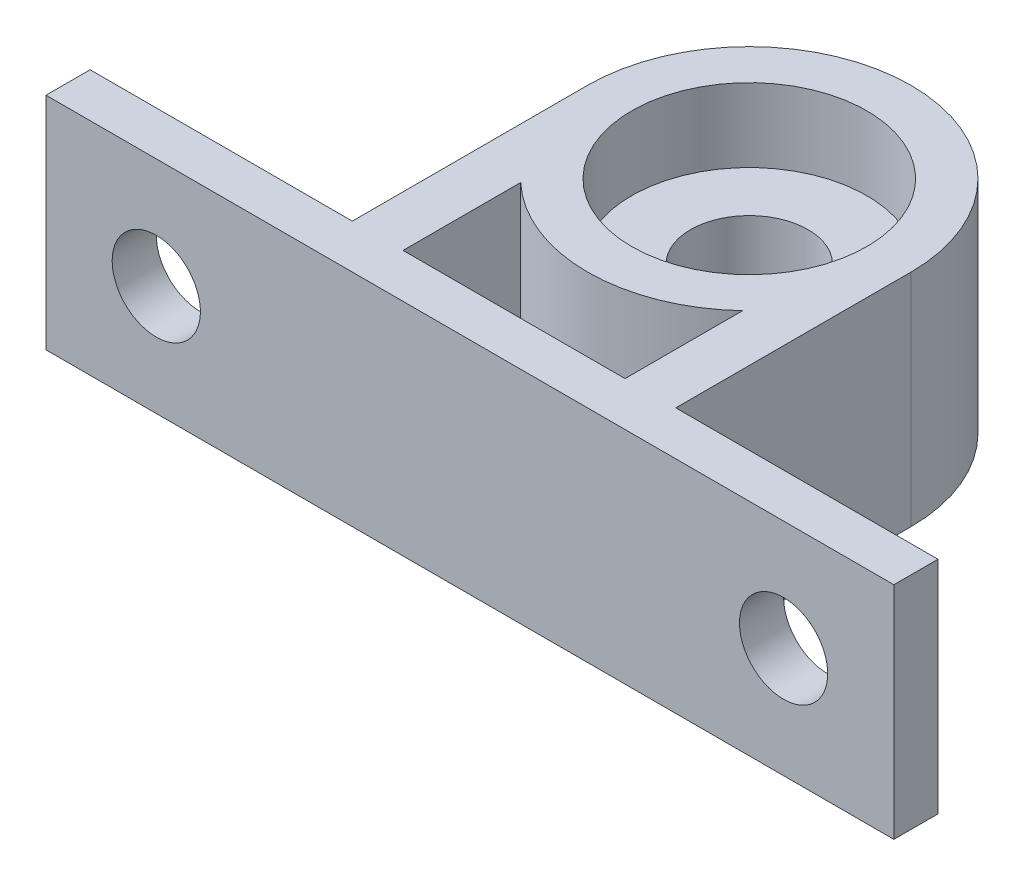
ISO-10303-21;
HEADER;
FILE_DESCRIPTION(('STEP AP214'),'2;1');
FILE_NAME('part.step','',(''),(''),'','','');
FILE_SCHEMA(('AUTOMOTIVE_DESIGN { 1 0 10303 214 1 1 1 1 }'));
ENDSEC;
DATA;
#1=APPLICATION_CONTEXT('core data for automotive mechanical design processes');
#2=APPLICATION_PROTOCOL_DEFINITION('international standard','automotive_design',2000,#1);
#3=PRODUCT_CONTEXT('',#1,'mechanical');
#4=PRODUCT('Part','Part','',(#3));
#5=PRODUCT_RELATED_PRODUCT_CATEGORY('part','',(#4));
#6=PRODUCT_DEFINITION_FORMATION('','',#4);
#7=PRODUCT_DEFINITION_CONTEXT('part definition',#1,'design');
#8=PRODUCT_DEFINITION('design','',#6,#7);
#9=PRODUCT_DEFINITION_SHAPE('','',#8);
#10=(LENGTH_UNIT() NAMED_UNIT(*) SI_UNIT(.MILLI.,.METRE.));
#11=(NAMED_UNIT(*) PLANE_ANGLE_UNIT() SI_UNIT($,.RADIAN.));
#12=(NAMED_UNIT(*) SI_UNIT($,.STERADIAN.) SOLID_ANGLE_UNIT());
#13=UNCERTAINTY_MEASURE_WITH_UNIT(LENGTH_MEASURE(1.E-05),#10,'distance_accuracy_value','');
#14=(GEOMETRIC_REPRESENTATION_CONTEXT(3) GLOBAL_UNCERTAINTY_ASSIGNED_CONTEXT((#13)) GLOBAL_UNIT_ASSIGNED_CONTEXT((#10,
#11,#12)) REPRESENTATION_CONTEXT('',''));
#15=CARTESIAN_POINT('',(0.,0.,0.));
#16=DIRECTION('',(0.,0.,1.));
#17=DIRECTION('',(1.,0.,0.));
#18=AXIS2_PLACEMENT_3D('',#15,#16,#17);
#19=CARTESIAN_POINT('',(0.,15.,0.));
#20=DIRECTION('',(0.,1.,0.));
#21=DIRECTION('',(0.,0.,1.));
#22=AXIS2_PLACEMENT_3D('',#19,#20,#21);
#23=PLANE('',#22);
#24=CARTESIAN_POINT('',(0.,15.,-3.99999999999992));
#25=DIRECTION('',(0.,1.,0.));
#26=DIRECTION('',(0.,0.,1.));
#27=AXIS2_PLACEMENT_3D('',#24,#25,#26);
#28=CIRCLE('',#27,8.);
#29=CARTESIAN_POINT('',(0.,15.,4.00000000000008));
#30=VERTEX_POINT('',#29);
#31=EDGE_CURVE('E317',#30,#30,#28,.T.);
#32=ORIENTED_EDGE('',*,*,#31,.F.);
#33=EDGE_LOOP('',(#32));
#34=FACE_BOUND('',#33,.T.);
#35=DIRECTION('',(0.,0.,1.));
#36=VECTOR('',#35,1.);
#37=CARTESIAN_POINT('',(11.0000000000001,15.,0.));
#38=LINE('',#37,#36);
#39=CARTESIAN_POINT('',(11.0000000000001,15.,-3.99999999999992));
#40=VERTEX_POINT('',#39);
#41=CARTESIAN_POINT('',(11.0000000000001,15.,12.));
#42=VERTEX_POINT('',#41);
#43=EDGE_CURVE('E259',#40,#42,#38,.T.);
#44=ORIENTED_EDGE('',*,*,#43,.F.);
#45=CARTESIAN_POINT('',(0.,15.,-3.99999999999992));
#46=DIRECTION('',(0.,1.,0.));
#47=DIRECTION('',(0.,0.,1.));
#48=AXIS2_PLACEMENT_3D('',#45,#46,#47);
#49=CIRCLE('',#48,11.);
#50=CARTESIAN_POINT('',(-11.0000000000001,15.,-3.99999999999992));
#51=VERTEX_POINT('',#50);
#52=EDGE_CURVE('E284',#40,#51,#49,.T.);
#53=ORIENTED_EDGE('',*,*,#52,.T.);
#54=DIRECTION('',(0.,0.,-1.));
#55=VECTOR('',#54,1.);
#56=CARTESIAN_POINT('',(-11.0000000000001,15.,0.));
#57=LINE('',#56,#55);
#58=CARTESIAN_POINT('',(-11.0000000000001,15.,12.));
#59=VERTEX_POINT('',#58);
#60=EDGE_CURVE('E295',#59,#51,#57,.T.);
#61=ORIENTED_EDGE('',*,*,#60,.F.);
#62=DIRECTION('',(1.,0.,0.));
#63=VECTOR('',#62,1.);
#64=CARTESIAN_POINT('',(0.,15.,12.));
#65=LINE('',#64,#63);
#66=CARTESIAN_POINT('',(-28.8339222614841,15.,12.));
#67=VERTEX_POINT('',#66);
#68=EDGE_CURVE('E307',#67,#59,#65,.T.);
#69=ORIENTED_EDGE('',*,*,#68,.F.);
#70=DIRECTION('',(0.,0.,1.));
#71=VECTOR('',#70,1.);
#72=CARTESIAN_POINT('',(-28.8339222614841,15.,-15.));
#73=LINE('',#72,#71);
#74=CARTESIAN_POINT('',(-28.8339222614841,15.,15.));
#75=VERTEX_POINT('',#74);
#76=EDGE_CURVE('E334',#67,#75,#73,.T.);
#77=ORIENTED_EDGE('',*,*,#76,.T.);
#78=DIRECTION('',(1.,0.,0.));
#79=VECTOR('',#78,1.);
#80=CARTESIAN_POINT('',(-28.8339222614841,15.,15.));
#81=LINE('',#80,#79);
#82=CARTESIAN_POINT('',(28.8339222614841,15.,15.));
#83=VERTEX_POINT('',#82);
#84=EDGE_CURVE('E338',#75,#83,#81,.T.);
#85=ORIENTED_EDGE('',*,*,#84,.T.);
#86=DIRECTION('',(0.,0.,-1.));
#87=VECTOR('',#86,1.);
#88=CARTESIAN_POINT('',(28.8339222614841,15.,-15.));
#89=LINE('',#88,#87);
#90=CARTESIAN_POINT('',(28.8339222614841,15.,12.));
#91=VERTEX_POINT('',#90);
#92=EDGE_CURVE('E330',#83,#91,#89,.T.);
#93=ORIENTED_EDGE('',*,*,#92,.T.);
#94=DIRECTION('',(1.,0.,0.));
#95=VECTOR('',#94,1.);
#96=CARTESIAN_POINT('',(0.,15.,12.));
#97=LINE('',#96,#95);
#98=EDGE_CURVE('E270',#42,#91,#97,.T.);
#99=ORIENTED_EDGE('',*,*,#98,.F.);
#100=EDGE_LOOP('',(#44,#53,#61,#69,#77,#85,#93,#99));
#101=FACE_BOUND('',#100,.T.);
#102=DIRECTION('',(0.,0.,1.));
#103=VECTOR('',#102,1.);
#104=CARTESIAN_POINT('',(-7.54983443527089,15.,0.));
#105=LINE('',#104,#103);
#106=CARTESIAN_POINT('',(-7.54983443527089,15.,4.));
#107=VERTEX_POINT('',#106);
#108=CARTESIAN_POINT('',(-7.54983443527089,15.,12.));
#109=VERTEX_POINT('',#108);
#110=EDGE_CURVE('E250',#107,#109,#105,.T.);
#111=ORIENTED_EDGE('',*,*,#110,.F.);
#112=CARTESIAN_POINT('',(0.,15.,-3.99999999999992));
#113=DIRECTION('',(0.,1.,0.));
#114=DIRECTION('',(0.,0.,1.));
#115=AXIS2_PLACEMENT_3D('',#112,#113,#114);
#116=CIRCLE('',#115,11.);
#117=CARTESIAN_POINT('',(7.54983443527078,15.,4.));
#118=VERTEX_POINT('',#117);
#119=EDGE_CURVE('E140',#107,#118,#116,.T.);
#120=ORIENTED_EDGE('',*,*,#119,.T.);
#121=DIRECTION('',(0.,0.,-1.));
#122=VECTOR('',#121,1.);
#123=CARTESIAN_POINT('',(7.54983443527078,15.,0.));
#124=LINE('',#123,#122);
#125=CARTESIAN_POINT('',(7.54983443527078,15.,12.));
#126=VERTEX_POINT('',#125);
#127=EDGE_CURVE('E234',#126,#118,#124,.T.);
#128=ORIENTED_EDGE('',*,*,#127,.F.);
#129=DIRECTION('',(1.,0.,0.));
#130=VECTOR('',#129,1.);
#131=CARTESIAN_POINT('',(0.,15.,12.));
#132=LINE('',#131,#130);
#133=EDGE_CURVE('E238',#109,#126,#132,.T.);
#134=ORIENTED_EDGE('',*,*,#133,.F.);
#135=EDGE_LOOP('',(#111,#120,#128,#134));
#136=FACE_BOUND('',#135,.T.);
#137=ADVANCED_FACE('F122',(#34,#101,#136),#23,.T.);
#138=CARTESIAN_POINT('',(0.,0.,0.));
#139=DIRECTION('',(0.,1.,0.));
#140=DIRECTION('',(0.,0.,1.));
#141=AXIS2_PLACEMENT_3D('',#138,#139,#140);
#142=PLANE('',#141);
#143=CARTESIAN_POINT('',(0.,0.,-3.99999999999992));
#144=DIRECTION('',(0.,1.,0.));
#145=DIRECTION('',(0.,0.,1.));
#146=AXIS2_PLACEMENT_3D('',#143,#144,#145);
#147=CIRCLE('',#146,11.);
#148=CARTESIAN_POINT('',(11.0000000000001,0.,-3.99999999999992));
#149=VERTEX_POINT('',#148);
#150=CARTESIAN_POINT('',(-11.0000000000001,0.,-3.99999999999992));
#151=VERTEX_POINT('',#150);
#152=EDGE_CURVE('E291',#149,#151,#147,.T.);
#153=ORIENTED_EDGE('',*,*,#152,.F.);
#154=DIRECTION('',(0.,0.,1.));
#155=VECTOR('',#154,1.);
#156=CARTESIAN_POINT('',(11.0000000000001,0.,0.));
#157=LINE('',#156,#155);
#158=CARTESIAN_POINT('',(11.0000000000001,0.,12.));
#159=VERTEX_POINT('',#158);
#160=EDGE_CURVE('E265',#149,#159,#157,.T.);
#161=ORIENTED_EDGE('',*,*,#160,.T.);
#162=DIRECTION('',(1.,0.,0.));
#163=VECTOR('',#162,1.);
#164=CARTESIAN_POINT('',(0.,0.,12.));
#165=LINE('',#164,#163);
#166=CARTESIAN_POINT('',(28.8339222614841,0.,12.));
#167=VERTEX_POINT('',#166);
#168=EDGE_CURVE('E269',#159,#167,#165,.T.);
#169=ORIENTED_EDGE('',*,*,#168,.T.);
#170=DIRECTION('',(0.,0.,-1.));
#171=VECTOR('',#170,1.);
#172=CARTESIAN_POINT('',(28.8339222614841,0.,-15.));
#173=LINE('',#172,#171);
#174=CARTESIAN_POINT('',(28.8339222614841,0.,15.));
#175=VERTEX_POINT('',#174);
#176=EDGE_CURVE('E341',#175,#167,#173,.T.);
#177=ORIENTED_EDGE('',*,*,#176,.F.);
#178=DIRECTION('',(1.,0.,0.));
#179=VECTOR('',#178,1.);
#180=CARTESIAN_POINT('',(-28.8339222614841,0.,15.));
#181=LINE('',#180,#179);
#182=CARTESIAN_POINT('',(-28.8339222614841,0.,15.));
#183=VERTEX_POINT('',#182);
#184=EDGE_CURVE('E335',#183,#175,#181,.T.);
#185=ORIENTED_EDGE('',*,*,#184,.F.);
#186=DIRECTION('',(0.,0.,1.));
#187=VECTOR('',#186,1.);
#188=CARTESIAN_POINT('',(-28.8339222614841,0.,-15.));
#189=LINE('',#188,#187);
#190=CARTESIAN_POINT('',(-28.8339222614841,0.,12.));
#191=VERTEX_POINT('',#190);
#192=EDGE_CURVE('E345',#191,#183,#189,.T.);
#193=ORIENTED_EDGE('',*,*,#192,.F.);
#194=DIRECTION('',(1.,0.,0.));
#195=VECTOR('',#194,1.);
#196=CARTESIAN_POINT('',(0.,0.,12.));
#197=LINE('',#196,#195);
#198=CARTESIAN_POINT('',(-11.0000000000001,0.,12.));
#199=VERTEX_POINT('',#198);
#200=EDGE_CURVE('E294',#191,#199,#197,.T.);
#201=ORIENTED_EDGE('',*,*,#200,.T.);
#202=DIRECTION('',(0.,0.,-1.));
#203=VECTOR('',#202,1.);
#204=CARTESIAN_POINT('',(-11.0000000000001,0.,0.));
#205=LINE('',#204,#203);
#206=EDGE_CURVE('E299',#199,#151,#205,.T.);
#207=ORIENTED_EDGE('',*,*,#206,.T.);
#208=EDGE_LOOP('',(#153,#161,#169,#177,#185,#193,#201,#207));
#209=FACE_BOUND('',#208,.T.);
#210=CARTESIAN_POINT('',(0.,0.,-3.99999999999992));
#211=DIRECTION('',(0.,1.,0.));
#212=DIRECTION('',(0.,0.,1.));
#213=AXIS2_PLACEMENT_3D('',#210,#211,#212);
#214=CIRCLE('',#213,4.);
#215=CARTESIAN_POINT('',(0.,0.,0.));
#216=VERTEX_POINT('',#215);
#217=EDGE_CURVE('E346',#216,#216,#214,.T.);
#218=ORIENTED_EDGE('',*,*,#217,.T.);
#219=EDGE_LOOP('',(#218));
#220=FACE_BOUND('',#219,.T.);
#221=CARTESIAN_POINT('',(0.,0.,-3.99999999999992));
#222=DIRECTION('',(0.,1.,0.));
#223=DIRECTION('',(0.,0.,1.));
#224=AXIS2_PLACEMENT_3D('',#221,#222,#223);
#225=CIRCLE('',#224,11.);
#226=CARTESIAN_POINT('',(-7.54983443527089,0.,4.));
#227=VERTEX_POINT('',#226);
#228=CARTESIAN_POINT('',(7.54983443527078,0.,4.));
#229=VERTEX_POINT('',#228);
#230=EDGE_CURVE('E215',#227,#229,#225,.T.);
#231=ORIENTED_EDGE('',*,*,#230,.F.);
#232=DIRECTION('',(0.,0.,1.));
#233=VECTOR('',#232,1.);
#234=CARTESIAN_POINT('',(-7.54983443527089,0.,0.));
#235=LINE('',#234,#233);
#236=CARTESIAN_POINT('',(-7.54983443527089,0.,12.));
#237=VERTEX_POINT('',#236);
#238=EDGE_CURVE('E225',#227,#237,#235,.T.);
#239=ORIENTED_EDGE('',*,*,#238,.T.);
#240=DIRECTION('',(1.,0.,0.));
#241=VECTOR('',#240,1.);
#242=CARTESIAN_POINT('',(0.,0.,12.));
#243=LINE('',#242,#241);
#244=CARTESIAN_POINT('',(7.54983443527078,0.,12.));
#245=VERTEX_POINT('',#244);
#246=EDGE_CURVE('E148',#237,#245,#243,.T.);
#247=ORIENTED_EDGE('',*,*,#246,.T.);
#248=DIRECTION('',(0.,0.,-1.));
#249=VECTOR('',#248,1.);
#250=CARTESIAN_POINT('',(7.54983443527078,0.,0.));
#251=LINE('',#250,#249);
#252=EDGE_CURVE('E222',#245,#229,#251,.T.);
#253=ORIENTED_EDGE('',*,*,#252,.T.);
#254=EDGE_LOOP('',(#231,#239,#247,#253));
#255=FACE_BOUND('',#254,.T.);
#256=ADVANCED_FACE('F231',(#209,#220,#255),#142,.F.);
#257=CARTESIAN_POINT('',(0.,-25.,-3.99999999999992));
#258=DIRECTION('',(0.,1.,0.));
#259=DIRECTION('',(0.,0.,1.));
#260=AXIS2_PLACEMENT_3D('',#257,#258,#259);
#261=CYLINDRICAL_SURFACE('',#260,4.);
#262=ORIENTED_EDGE('',*,*,#217,.F.);
#263=EDGE_LOOP('',(#262));
#264=FACE_BOUND('',#263,.T.);
#265=CARTESIAN_POINT('',(0.,10.,-3.99999999999992));
#266=DIRECTION('',(0.,1.,0.));
#267=DIRECTION('',(0.,0.,1.));
#268=AXIS2_PLACEMENT_3D('',#265,#266,#267);
#269=CIRCLE('',#268,4.);
#270=CARTESIAN_POINT('',(0.,10.,0.));
#271=VERTEX_POINT('',#270);
#272=EDGE_CURVE('E126',#271,#271,#269,.F.);
#273=ORIENTED_EDGE('',*,*,#272,.F.);
#274=EDGE_LOOP('',(#273));
#275=FACE_BOUND('',#274,.T.);
#276=ADVANCED_FACE('F363',(#264,#275),#261,.F.);
#277=CARTESIAN_POINT('',(28.8339222614841,15.,-15.));
#278=DIRECTION('',(-1.,0.,0.));
#279=DIRECTION('',(0.,0.,1.));
#280=AXIS2_PLACEMENT_3D('',#277,#278,#279);
#281=PLANE('',#280);
#282=ORIENTED_EDGE('',*,*,#176,.T.);
#283=DIRECTION('',(0.,1.,0.));
#284=VECTOR('',#283,1.);
#285=CARTESIAN_POINT('',(28.8339222614841,0.,12.));
#286=LINE('',#285,#284);
#287=EDGE_CURVE('E280',#167,#91,#286,.T.);
#288=ORIENTED_EDGE('',*,*,#287,.T.);
#289=ORIENTED_EDGE('',*,*,#92,.F.);
#290=DIRECTION('',(0.,-1.,0.));
#291=VECTOR('',#290,1.);
#292=CARTESIAN_POINT('',(28.8339222614841,15.,15.));
#293=LINE('',#292,#291);
#294=EDGE_CURVE('E132',#83,#175,#293,.T.);
#295=ORIENTED_EDGE('',*,*,#294,.T.);
#296=EDGE_LOOP('',(#282,#288,#289,#295));
#297=FACE_BOUND('',#296,.T.);
#298=ADVANCED_FACE('F124',(#297),#281,.F.);
#299=CARTESIAN_POINT('',(-28.8339222614841,15.,-15.));
#300=DIRECTION('',(1.,0.,0.));
#301=DIRECTION('',(0.,0.,-1.));
#302=AXIS2_PLACEMENT_3D('',#299,#300,#301);
#303=PLANE('',#302);
#304=ORIENTED_EDGE('',*,*,#76,.F.);
#305=DIRECTION('',(0.,1.,0.));
#306=VECTOR('',#305,1.);
#307=CARTESIAN_POINT('',(-28.8339222614841,0.,12.));
#308=LINE('',#307,#306);
#309=EDGE_CURVE('E303',#191,#67,#308,.T.);
#310=ORIENTED_EDGE('',*,*,#309,.F.);
#311=ORIENTED_EDGE('',*,*,#192,.T.);
#312=DIRECTION('',(0.,-1.,0.));
#313=VECTOR('',#312,1.);
#314=CARTESIAN_POINT('',(-28.8339222614841,15.,15.));
#315=LINE('',#314,#313);
#316=EDGE_CURVE('E12',#75,#183,#315,.T.);
#317=ORIENTED_EDGE('',*,*,#316,.F.);
#318=EDGE_LOOP('',(#304,#310,#311,#317));
#319=FACE_BOUND('',#318,.T.);
#320=ADVANCED_FACE('F371',(#319),#303,.F.);
#321=CARTESIAN_POINT('',(-28.8339222614841,15.,15.));
#322=DIRECTION('',(0.,0.,-1.));
#323=DIRECTION('',(-1.,0.,0.));
#324=AXIS2_PLACEMENT_3D('',#321,#322,#323);
#325=PLANE('',#324);
#326=CARTESIAN_POINT('',(-21.3339222614841,7.5,15.));
#327=DIRECTION('',(0.,0.,-1.));
#328=DIRECTION('',(-1.,0.,0.));
#329=AXIS2_PLACEMENT_3D('',#326,#327,#328);
#330=CIRCLE('',#329,3.);
#331=CARTESIAN_POINT('',(-24.3339222614841,7.5,15.));
#332=VERTEX_POINT('',#331);
#333=EDGE_CURVE('E241',#332,#332,#330,.T.);
#334=ORIENTED_EDGE('',*,*,#333,.T.);
#335=EDGE_LOOP('',(#334));
#336=FACE_BOUND('',#335,.T.);
#337=CARTESIAN_POINT('',(21.3339222614841,7.5,15.));
#338=DIRECTION('',(0.,0.,-1.));
#339=DIRECTION('',(-1.,0.,0.));
#340=AXIS2_PLACEMENT_3D('',#337,#338,#339);
#341=CIRCLE('',#340,3.);
#342=CARTESIAN_POINT('',(18.3339222614841,7.5,15.));
#343=VERTEX_POINT('',#342);
#344=EDGE_CURVE('E546',#343,#343,#341,.T.);
#345=ORIENTED_EDGE('',*,*,#344,.T.);
#346=EDGE_LOOP('',(#345));
#347=FACE_BOUND('',#346,.T.);
#348=ORIENTED_EDGE('',*,*,#184,.T.);
#349=ORIENTED_EDGE('',*,*,#294,.F.);
#350=ORIENTED_EDGE('',*,*,#84,.F.);
#351=ORIENTED_EDGE('',*,*,#316,.T.);
#352=EDGE_LOOP('',(#348,#349,#350,#351));
#353=FACE_BOUND('',#352,.T.);
#354=ADVANCED_FACE('F386',(#336,#347,#353),#325,.F.);
#355=CARTESIAN_POINT('',(0.,10.,-3.99999999999992));
#356=DIRECTION('',(0.,1.,0.));
#357=DIRECTION('',(0.,0.,1.));
#358=AXIS2_PLACEMENT_3D('',#355,#356,#357);
#359=PLANE('',#358);
#360=CARTESIAN_POINT('',(0.,10.,-3.99999999999992));
#361=DIRECTION('',(0.,1.,0.));
#362=DIRECTION('',(0.,0.,1.));
#363=AXIS2_PLACEMENT_3D('',#360,#361,#362);
#364=CIRCLE('',#363,8.);
#365=CARTESIAN_POINT('',(0.,10.,4.00000000000008));
#366=VERTEX_POINT('',#365);
#367=EDGE_CURVE('E323',#366,#366,#364,.T.);
#368=ORIENTED_EDGE('',*,*,#367,.T.);
#369=EDGE_LOOP('',(#368));
#370=FACE_BOUND('',#369,.T.);
#371=ORIENTED_EDGE('',*,*,#272,.T.);
#372=EDGE_LOOP('',(#371));
#373=FACE_BOUND('',#372,.T.);
#374=ADVANCED_FACE('F361',(#370,#373),#359,.T.);
#375=CARTESIAN_POINT('',(0.,10.,-3.99999999999992));
#376=DIRECTION('',(0.,1.,0.));
#377=DIRECTION('',(0.,0.,1.));
#378=AXIS2_PLACEMENT_3D('',#375,#376,#377);
#379=CYLINDRICAL_SURFACE('',#378,8.);
#380=ORIENTED_EDGE('',*,*,#367,.F.);
#381=EDGE_LOOP('',(#380));
#382=FACE_BOUND('',#381,.T.);
#383=ORIENTED_EDGE('',*,*,#31,.T.);
#384=EDGE_LOOP('',(#383));
#385=FACE_BOUND('',#384,.T.);
#386=ADVANCED_FACE('F432',(#382,#385),#379,.F.);
#387=CARTESIAN_POINT('',(0.,0.,-3.99999999999992));
#388=DIRECTION('',(0.,1.,0.));
#389=DIRECTION('',(0.,0.,1.));
#390=AXIS2_PLACEMENT_3D('',#387,#388,#389);
#391=CYLINDRICAL_SURFACE('',#390,11.);
#392=ORIENTED_EDGE('',*,*,#52,.F.);
#393=DIRECTION('',(0.,1.,0.));
#394=VECTOR('',#393,1.);
#395=CARTESIAN_POINT('',(11.0000000000001,0.,-3.99999999999992));
#396=LINE('',#395,#394);
#397=EDGE_CURVE('E274',#149,#40,#396,.T.);
#398=ORIENTED_EDGE('',*,*,#397,.F.);
#399=ORIENTED_EDGE('',*,*,#152,.T.);
#400=DIRECTION('',(0.,1.,0.));
#401=VECTOR('',#400,1.);
#402=CARTESIAN_POINT('',(-11.0000000000001,0.,-3.99999999999992));
#403=LINE('',#402,#401);
#404=EDGE_CURVE('E314',#151,#51,#403,.T.);
#405=ORIENTED_EDGE('',*,*,#404,.T.);
#406=EDGE_LOOP('',(#392,#398,#399,#405));
#407=FACE_BOUND('',#406,.T.);
#408=ADVANCED_FACE('F420',(#407),#391,.T.);
#409=CARTESIAN_POINT('',(-11.0000000000001,0.,0.));
#410=DIRECTION('',(1.,0.,0.));
#411=DIRECTION('',(0.,0.,-1.));
#412=AXIS2_PLACEMENT_3D('',#409,#410,#411);
#413=PLANE('',#412);
#414=ORIENTED_EDGE('',*,*,#60,.T.);
#415=ORIENTED_EDGE('',*,*,#404,.F.);
#416=ORIENTED_EDGE('',*,*,#206,.F.);
#417=DIRECTION('',(0.,1.,0.));
#418=VECTOR('',#417,1.);
#419=CARTESIAN_POINT('',(-11.0000000000001,0.,12.));
#420=LINE('',#419,#418);
#421=EDGE_CURVE('E318',#199,#59,#420,.T.);
#422=ORIENTED_EDGE('',*,*,#421,.T.);
#423=EDGE_LOOP('',(#414,#415,#416,#422));
#424=FACE_BOUND('',#423,.T.);
#425=ADVANCED_FACE('F423',(#424),#413,.F.);
#426=CARTESIAN_POINT('',(0.,0.,12.));
#427=DIRECTION('',(0.,0.,1.));
#428=DIRECTION('',(1.,0.,0.));
#429=AXIS2_PLACEMENT_3D('',#426,#427,#428);
#430=PLANE('',#429);
#431=CARTESIAN_POINT('',(-21.3339222614841,7.5,12.));
#432=DIRECTION('',(0.,0.,-1.));
#433=DIRECTION('',(-1.,0.,0.));
#434=AXIS2_PLACEMENT_3D('',#431,#432,#433);
#435=CIRCLE('',#434,3.);
#436=CARTESIAN_POINT('',(-24.3339222614841,7.5,12.));
#437=VERTEX_POINT('',#436);
#438=EDGE_CURVE('E542',#437,#437,#435,.T.);
#439=ORIENTED_EDGE('',*,*,#438,.F.);
#440=EDGE_LOOP('',(#439));
#441=FACE_BOUND('',#440,.T.);
#442=ORIENTED_EDGE('',*,*,#68,.T.);
#443=ORIENTED_EDGE('',*,*,#421,.F.);
#444=ORIENTED_EDGE('',*,*,#200,.F.);
#445=ORIENTED_EDGE('',*,*,#309,.T.);
#446=EDGE_LOOP('',(#442,#443,#444,#445));
#447=FACE_BOUND('',#446,.T.);
#448=ADVANCED_FACE('F406',(#441,#447),#430,.F.);
#449=CARTESIAN_POINT('',(0.,0.,12.));
#450=DIRECTION('',(0.,0.,1.));
#451=DIRECTION('',(1.,0.,0.));
#452=AXIS2_PLACEMENT_3D('',#449,#450,#451);
#453=PLANE('',#452);
#454=CARTESIAN_POINT('',(21.3339222614841,7.5,12.));
#455=DIRECTION('',(0.,0.,-1.));
#456=DIRECTION('',(-1.,0.,0.));
#457=AXIS2_PLACEMENT_3D('',#454,#455,#456);
#458=CIRCLE('',#457,3.);
#459=CARTESIAN_POINT('',(18.3339222614841,7.5,12.));
#460=VERTEX_POINT('',#459);
#461=EDGE_CURVE('E552',#460,#460,#458,.T.);
#462=ORIENTED_EDGE('',*,*,#461,.F.);
#463=EDGE_LOOP('',(#462));
#464=FACE_BOUND('',#463,.T.);
#465=ORIENTED_EDGE('',*,*,#98,.T.);
#466=ORIENTED_EDGE('',*,*,#287,.F.);
#467=ORIENTED_EDGE('',*,*,#168,.F.);
#468=DIRECTION('',(0.,1.,0.));
#469=VECTOR('',#468,1.);
#470=CARTESIAN_POINT('',(11.0000000000001,0.,12.));
#471=LINE('',#470,#469);
#472=EDGE_CURVE('E285',#159,#42,#471,.T.);
#473=ORIENTED_EDGE('',*,*,#472,.T.);
#474=EDGE_LOOP('',(#465,#466,#467,#473));
#475=FACE_BOUND('',#474,.T.);
#476=ADVANCED_FACE('F413',(#464,#475),#453,.F.);
#477=CARTESIAN_POINT('',(11.0000000000001,0.,0.));
#478=DIRECTION('',(-1.,0.,0.));
#479=DIRECTION('',(0.,0.,1.));
#480=AXIS2_PLACEMENT_3D('',#477,#478,#479);
#481=PLANE('',#480);
#482=ORIENTED_EDGE('',*,*,#43,.T.);
#483=ORIENTED_EDGE('',*,*,#472,.F.);
#484=ORIENTED_EDGE('',*,*,#160,.F.);
#485=ORIENTED_EDGE('',*,*,#397,.T.);
#486=EDGE_LOOP('',(#482,#483,#484,#485));
#487=FACE_BOUND('',#486,.T.);
#488=ADVANCED_FACE('F417',(#487),#481,.F.);
#489=CARTESIAN_POINT('',(0.,0.,-3.99999999999992));
#490=DIRECTION('',(0.,1.,0.));
#491=DIRECTION('',(0.,0.,1.));
#492=AXIS2_PLACEMENT_3D('',#489,#490,#491);
#493=CYLINDRICAL_SURFACE('',#492,11.);
#494=ORIENTED_EDGE('',*,*,#119,.F.);
#495=DIRECTION('',(0.,1.,0.));
#496=VECTOR('',#495,1.);
#497=CARTESIAN_POINT('',(-7.54983443527089,0.,4.));
#498=LINE('',#497,#496);
#499=EDGE_CURVE('E211',#227,#107,#498,.T.);
#500=ORIENTED_EDGE('',*,*,#499,.F.);
#501=ORIENTED_EDGE('',*,*,#230,.T.);
#502=DIRECTION('',(0.,1.,0.));
#503=VECTOR('',#502,1.);
#504=CARTESIAN_POINT('',(7.54983443527078,0.,4.));
#505=LINE('',#504,#503);
#506=EDGE_CURVE('E256',#229,#118,#505,.T.);
#507=ORIENTED_EDGE('',*,*,#506,.T.);
#508=EDGE_LOOP('',(#494,#500,#501,#507));
#509=FACE_BOUND('',#508,.T.);
#510=ADVANCED_FACE('F213',(#509),#493,.T.);
#511=CARTESIAN_POINT('',(7.54983443527078,0.,0.));
#512=DIRECTION('',(1.,0.,0.));
#513=DIRECTION('',(0.,0.,-1.));
#514=AXIS2_PLACEMENT_3D('',#511,#512,#513);
#515=PLANE('',#514);
#516=ORIENTED_EDGE('',*,*,#127,.T.);
#517=ORIENTED_EDGE('',*,*,#506,.F.);
#518=ORIENTED_EDGE('',*,*,#252,.F.);
#519=DIRECTION('',(0.,1.,0.));
#520=VECTOR('',#519,1.);
#521=CARTESIAN_POINT('',(7.54983443527078,0.,12.));
#522=LINE('',#521,#520);
#523=EDGE_CURVE('E260',#245,#126,#522,.T.);
#524=ORIENTED_EDGE('',*,*,#523,.T.);
#525=EDGE_LOOP('',(#516,#517,#518,#524));
#526=FACE_BOUND('',#525,.T.);
#527=ADVANCED_FACE('F473',(#526),#515,.F.);
#528=CARTESIAN_POINT('',(0.,0.,12.));
#529=DIRECTION('',(0.,0.,1.));
#530=DIRECTION('',(1.,0.,0.));
#531=AXIS2_PLACEMENT_3D('',#528,#529,#530);
#532=PLANE('',#531);
#533=ORIENTED_EDGE('',*,*,#133,.T.);
#534=ORIENTED_EDGE('',*,*,#523,.F.);
#535=ORIENTED_EDGE('',*,*,#246,.F.);
#536=DIRECTION('',(0.,1.,0.));
#537=VECTOR('',#536,1.);
#538=CARTESIAN_POINT('',(-7.54983443527089,0.,12.));
#539=LINE('',#538,#537);
#540=EDGE_CURVE('E221',#237,#109,#539,.T.);
#541=ORIENTED_EDGE('',*,*,#540,.T.);
#542=EDGE_LOOP('',(#533,#534,#535,#541));
#543=FACE_BOUND('',#542,.T.);
#544=ADVANCED_FACE('F482',(#543),#532,.F.);
#545=CARTESIAN_POINT('',(-7.54983443527089,0.,0.));
#546=DIRECTION('',(-1.,0.,0.));
#547=DIRECTION('',(0.,0.,1.));
#548=AXIS2_PLACEMENT_3D('',#545,#546,#547);
#549=PLANE('',#548);
#550=ORIENTED_EDGE('',*,*,#110,.T.);
#551=ORIENTED_EDGE('',*,*,#540,.F.);
#552=ORIENTED_EDGE('',*,*,#238,.F.);
#553=ORIENTED_EDGE('',*,*,#499,.T.);
#554=EDGE_LOOP('',(#550,#551,#552,#553));
#555=FACE_BOUND('',#554,.T.);
#556=ADVANCED_FACE('F226',(#555),#549,.F.);
#557=CARTESIAN_POINT('',(21.3339222614841,7.5,17.));
#558=DIRECTION('',(0.,0.,-1.));
#559=DIRECTION('',(-1.,0.,0.));
#560=AXIS2_PLACEMENT_3D('',#557,#558,#559);
#561=CYLINDRICAL_SURFACE('',#560,3.);
#562=ORIENTED_EDGE('',*,*,#461,.T.);
#563=EDGE_LOOP('',(#562));
#564=FACE_BOUND('',#563,.T.);
#565=ORIENTED_EDGE('',*,*,#344,.F.);
#566=EDGE_LOOP('',(#565));
#567=FACE_BOUND('',#566,.T.);
#568=ADVANCED_FACE('F499',(#564,#567),#561,.F.);
#569=CARTESIAN_POINT('',(-21.3339222614841,7.5,17.));
#570=DIRECTION('',(0.,0.,-1.));
#571=DIRECTION('',(-1.,0.,0.));
#572=AXIS2_PLACEMENT_3D('',#569,#570,#571);
#573=CYLINDRICAL_SURFACE('',#572,3.);
#574=ORIENTED_EDGE('',*,*,#438,.T.);
#575=EDGE_LOOP('',(#574));
#576=FACE_BOUND('',#575,.T.);
#577=ORIENTED_EDGE('',*,*,#333,.F.);
#578=EDGE_LOOP('',(#577));
#579=FACE_BOUND('',#578,.T.);
#580=ADVANCED_FACE('F525',(#576,#579),#573,.F.);
#581=CLOSED_SHELL('',(#137,#256,#276,#298,#320,#354,#374,#386,#408,#425,#448,#476,#488,#510,
#527,#544,#556,#568,#580));
#582=MANIFOLD_SOLID_BREP('B2',#581);
#583=ADVANCED_BREP_SHAPE_REPRESENTATION('',(#18,#582),#14);
#584=SHAPE_DEFINITION_REPRESENTATION(#9,#583);
ENDSEC;
END-ISO-10303-21;
